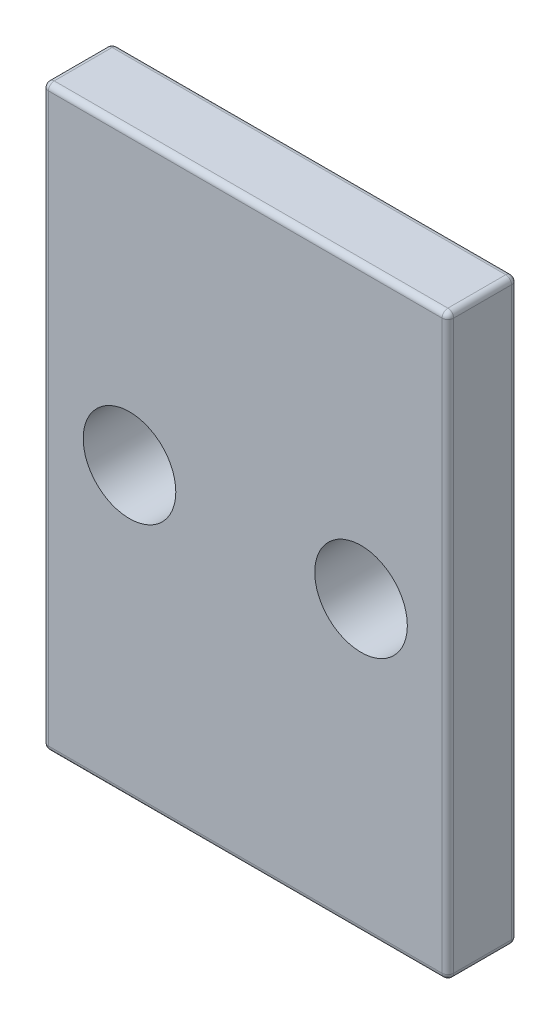
ISO-10303-21;
HEADER;
FILE_DESCRIPTION(('STEP AP214'),'2;1');
FILE_NAME('part.step','',(''),(''),'','','');
FILE_SCHEMA(('AUTOMOTIVE_DESIGN { 1 0 10303 214 1 1 1 1 }'));
ENDSEC;
DATA;
#1=APPLICATION_CONTEXT('core data for automotive mechanical design processes');
#2=APPLICATION_PROTOCOL_DEFINITION('international standard','automotive_design',2000,#1);
#3=PRODUCT_CONTEXT('',#1,'mechanical');
#4=PRODUCT('Part','Part','',(#3));
#5=PRODUCT_RELATED_PRODUCT_CATEGORY('part','',(#4));
#6=PRODUCT_DEFINITION_FORMATION('','',#4);
#7=PRODUCT_DEFINITION_CONTEXT('part definition',#1,'design');
#8=PRODUCT_DEFINITION('design','',#6,#7);
#9=PRODUCT_DEFINITION_SHAPE('','',#8);
#10=(LENGTH_UNIT() NAMED_UNIT(*) SI_UNIT(.MILLI.,.METRE.));
#11=(NAMED_UNIT(*) PLANE_ANGLE_UNIT() SI_UNIT($,.RADIAN.));
#12=(NAMED_UNIT(*) SI_UNIT($,.STERADIAN.) SOLID_ANGLE_UNIT());
#13=UNCERTAINTY_MEASURE_WITH_UNIT(LENGTH_MEASURE(1.E-05),#10,'distance_accuracy_value','');
#14=(GEOMETRIC_REPRESENTATION_CONTEXT(3) GLOBAL_UNCERTAINTY_ASSIGNED_CONTEXT((#13)) GLOBAL_UNIT_ASSIGNED_CONTEXT((#10,
#11,#12)) REPRESENTATION_CONTEXT('',''));
#15=CARTESIAN_POINT('',(0.,0.,0.));
#16=DIRECTION('',(0.,0.,1.));
#17=DIRECTION('',(1.,0.,0.));
#18=AXIS2_PLACEMENT_3D('',#15,#16,#17);
#19=CARTESIAN_POINT('',(0.,0.,6.));
#20=DIRECTION('',(0.,0.,1.));
#21=DIRECTION('',(1.,0.,0.));
#22=AXIS2_PLACEMENT_3D('',#19,#20,#21);
#23=PLANE('',#22);
#24=DIRECTION('',(0.,1.,0.));
#25=VECTOR('',#24,1.);
#26=CARTESIAN_POINT('',(17.,25.,6.));
#27=LINE('',#26,#25);
#28=CARTESIAN_POINT('',(17.,-24.5,6.));
#29=VERTEX_POINT('',#28);
#30=CARTESIAN_POINT('',(17.,24.5,6.));
#31=VERTEX_POINT('',#30);
#32=EDGE_CURVE('E171',#29,#31,#27,.T.);
#33=ORIENTED_EDGE('',*,*,#32,.T.);
#34=DIRECTION('',(-1.,0.,0.));
#35=VECTOR('',#34,1.);
#36=CARTESIAN_POINT('',(-17.5,24.5,6.));
#37=LINE('',#36,#35);
#38=CARTESIAN_POINT('',(-17.,24.5,6.));
#39=VERTEX_POINT('',#38);
#40=EDGE_CURVE('E140',#31,#39,#37,.T.);
#41=ORIENTED_EDGE('',*,*,#40,.T.);
#42=DIRECTION('',(0.,-1.,0.));
#43=VECTOR('',#42,1.);
#44=CARTESIAN_POINT('',(-17.,-25.,6.));
#45=LINE('',#44,#43);
#46=CARTESIAN_POINT('',(-17.,-24.5,6.));
#47=VERTEX_POINT('',#46);
#48=EDGE_CURVE('E159',#39,#47,#45,.T.);
#49=ORIENTED_EDGE('',*,*,#48,.T.);
#50=DIRECTION('',(1.,0.,0.));
#51=VECTOR('',#50,1.);
#52=CARTESIAN_POINT('',(17.5,-24.5,6.));
#53=LINE('',#52,#51);
#54=EDGE_CURVE('E166',#47,#29,#53,.T.);
#55=ORIENTED_EDGE('',*,*,#54,.T.);
#56=EDGE_LOOP('',(#33,#41,#49,#55));
#57=FACE_BOUND('',#56,.T.);
#58=CARTESIAN_POINT('',(-10.,0.,6.));
#59=DIRECTION('',(0.,0.,1.));
#60=DIRECTION('',(1.,0.,0.));
#61=AXIS2_PLACEMENT_3D('',#58,#59,#60);
#62=CIRCLE('',#61,4.);
#63=CARTESIAN_POINT('',(-6.,0.,6.));
#64=VERTEX_POINT('',#63);
#65=EDGE_CURVE('E167',#64,#64,#62,.T.);
#66=ORIENTED_EDGE('',*,*,#65,.F.);
#67=EDGE_LOOP('',(#66));
#68=FACE_BOUND('',#67,.T.);
#69=CARTESIAN_POINT('',(10.,0.,6.));
#70=DIRECTION('',(0.,0.,1.));
#71=DIRECTION('',(1.,0.,0.));
#72=AXIS2_PLACEMENT_3D('',#69,#70,#71);
#73=CIRCLE('',#72,4.);
#74=CARTESIAN_POINT('',(14.,0.,6.));
#75=VERTEX_POINT('',#74);
#76=EDGE_CURVE('E320',#75,#75,#73,.T.);
#77=ORIENTED_EDGE('',*,*,#76,.F.);
#78=EDGE_LOOP('',(#77));
#79=FACE_BOUND('',#78,.T.);
#80=ADVANCED_FACE('F45',(#57,#68,#79),#23,.T.);
#81=CARTESIAN_POINT('',(0.,0.,0.));
#82=DIRECTION('',(0.,0.,1.));
#83=DIRECTION('',(1.,0.,0.));
#84=AXIS2_PLACEMENT_3D('',#81,#82,#83);
#85=PLANE('',#84);
#86=DIRECTION('',(0.,-1.,0.));
#87=VECTOR('',#86,1.);
#88=CARTESIAN_POINT('',(-17.,0.,0.));
#89=LINE('',#88,#87);
#90=CARTESIAN_POINT('',(-17.,-24.5,0.));
#91=VERTEX_POINT('',#90);
#92=CARTESIAN_POINT('',(-17.,24.5,0.));
#93=VERTEX_POINT('',#92);
#94=EDGE_CURVE('E190',#91,#93,#89,.F.);
#95=ORIENTED_EDGE('',*,*,#94,.T.);
#96=DIRECTION('',(-1.,0.,0.));
#97=VECTOR('',#96,1.);
#98=CARTESIAN_POINT('',(0.,24.5,0.));
#99=LINE('',#98,#97);
#100=CARTESIAN_POINT('',(17.,24.5,0.));
#101=VERTEX_POINT('',#100);
#102=EDGE_CURVE('E199',#93,#101,#99,.F.);
#103=ORIENTED_EDGE('',*,*,#102,.T.);
#104=DIRECTION('',(0.,1.,0.));
#105=VECTOR('',#104,1.);
#106=CARTESIAN_POINT('',(17.,0.,0.));
#107=LINE('',#106,#105);
#108=CARTESIAN_POINT('',(17.,-24.5,0.));
#109=VERTEX_POINT('',#108);
#110=EDGE_CURVE('E196',#101,#109,#107,.F.);
#111=ORIENTED_EDGE('',*,*,#110,.T.);
#112=DIRECTION('',(1.,0.,0.));
#113=VECTOR('',#112,1.);
#114=CARTESIAN_POINT('',(0.,-24.5,0.));
#115=LINE('',#114,#113);
#116=EDGE_CURVE('E193',#109,#91,#115,.F.);
#117=ORIENTED_EDGE('',*,*,#116,.T.);
#118=EDGE_LOOP('',(#95,#103,#111,#117));
#119=FACE_BOUND('',#118,.T.);
#120=CARTESIAN_POINT('',(-10.,0.,0.));
#121=DIRECTION('',(0.,0.,1.));
#122=DIRECTION('',(1.,0.,0.));
#123=AXIS2_PLACEMENT_3D('',#120,#121,#122);
#124=CIRCLE('',#123,4.);
#125=CARTESIAN_POINT('',(-6.,0.,0.));
#126=VERTEX_POINT('',#125);
#127=EDGE_CURVE('E326',#126,#126,#124,.T.);
#128=ORIENTED_EDGE('',*,*,#127,.T.);
#129=EDGE_LOOP('',(#128));
#130=FACE_BOUND('',#129,.T.);
#131=CARTESIAN_POINT('',(10.,0.,0.));
#132=DIRECTION('',(0.,0.,1.));
#133=DIRECTION('',(1.,0.,0.));
#134=AXIS2_PLACEMENT_3D('',#131,#132,#133);
#135=CIRCLE('',#134,4.);
#136=CARTESIAN_POINT('',(14.,0.,0.));
#137=VERTEX_POINT('',#136);
#138=EDGE_CURVE('E313',#137,#137,#135,.T.);
#139=ORIENTED_EDGE('',*,*,#138,.T.);
#140=EDGE_LOOP('',(#139));
#141=FACE_BOUND('',#140,.T.);
#142=ADVANCED_FACE('F389',(#119,#130,#141),#85,.F.);
#143=CARTESIAN_POINT('',(17.5,25.,6.));
#144=DIRECTION('',(-1.,0.,0.));
#145=DIRECTION('',(0.,-1.,0.));
#146=AXIS2_PLACEMENT_3D('',#143,#144,#145);
#147=PLANE('',#146);
#148=DIRECTION('',(0.,0.,-1.));
#149=VECTOR('',#148,1.);
#150=CARTESIAN_POINT('',(17.5,24.5,6.));
#151=LINE('',#150,#149);
#152=CARTESIAN_POINT('',(17.5,24.5,0.5));
#153=VERTEX_POINT('',#152);
#154=CARTESIAN_POINT('',(17.5,24.5,5.5));
#155=VERTEX_POINT('',#154);
#156=EDGE_CURVE('E209',#153,#155,#151,.F.);
#157=ORIENTED_EDGE('',*,*,#156,.T.);
#158=DIRECTION('',(0.,1.,0.));
#159=VECTOR('',#158,1.);
#160=CARTESIAN_POINT('',(17.5,-25.,5.5));
#161=LINE('',#160,#159);
#162=CARTESIAN_POINT('',(17.5,-24.5,5.5));
#163=VERTEX_POINT('',#162);
#164=EDGE_CURVE('E212',#155,#163,#161,.F.);
#165=ORIENTED_EDGE('',*,*,#164,.T.);
#166=DIRECTION('',(0.,0.,-1.));
#167=VECTOR('',#166,1.);
#168=CARTESIAN_POINT('',(17.5,-24.5,6.));
#169=LINE('',#168,#167);
#170=CARTESIAN_POINT('',(17.5,-24.5,0.5));
#171=VERTEX_POINT('',#170);
#172=EDGE_CURVE('E203',#163,#171,#169,.T.);
#173=ORIENTED_EDGE('',*,*,#172,.T.);
#174=DIRECTION('',(0.,1.,0.));
#175=VECTOR('',#174,1.);
#176=CARTESIAN_POINT('',(17.5,25.,0.5));
#177=LINE('',#176,#175);
#178=EDGE_CURVE('E206',#171,#153,#177,.T.);
#179=ORIENTED_EDGE('',*,*,#178,.T.);
#180=EDGE_LOOP('',(#157,#165,#173,#179));
#181=FACE_BOUND('',#180,.T.);
#182=ADVANCED_FACE('F395',(#181),#147,.F.);
#183=CARTESIAN_POINT('',(-17.5,25.,6.));
#184=DIRECTION('',(0.,-1.,0.));
#185=DIRECTION('',(0.,0.,-1.));
#186=AXIS2_PLACEMENT_3D('',#183,#184,#185);
#187=PLANE('',#186);
#188=DIRECTION('',(-1.,0.,0.));
#189=VECTOR('',#188,1.);
#190=CARTESIAN_POINT('',(17.5,25.,5.5));
#191=LINE('',#190,#189);
#192=CARTESIAN_POINT('',(-17.,25.,5.5));
#193=VERTEX_POINT('',#192);
#194=CARTESIAN_POINT('',(17.,25.,5.5));
#195=VERTEX_POINT('',#194);
#196=EDGE_CURVE('E142',#193,#195,#191,.F.);
#197=ORIENTED_EDGE('',*,*,#196,.T.);
#198=DIRECTION('',(0.,0.,-1.));
#199=VECTOR('',#198,1.);
#200=CARTESIAN_POINT('',(17.,25.,6.));
#201=LINE('',#200,#199);
#202=CARTESIAN_POINT('',(17.,25.,0.5));
#203=VERTEX_POINT('',#202);
#204=EDGE_CURVE('E187',#195,#203,#201,.T.);
#205=ORIENTED_EDGE('',*,*,#204,.T.);
#206=DIRECTION('',(-1.,0.,0.));
#207=VECTOR('',#206,1.);
#208=CARTESIAN_POINT('',(-17.5,25.,0.5));
#209=LINE('',#208,#207);
#210=CARTESIAN_POINT('',(-17.,25.,0.5));
#211=VERTEX_POINT('',#210);
#212=EDGE_CURVE('E178',#203,#211,#209,.T.);
#213=ORIENTED_EDGE('',*,*,#212,.T.);
#214=DIRECTION('',(0.,0.,-1.));
#215=VECTOR('',#214,1.);
#216=CARTESIAN_POINT('',(-17.,25.,6.));
#217=LINE('',#216,#215);
#218=EDGE_CURVE('E174',#211,#193,#217,.F.);
#219=ORIENTED_EDGE('',*,*,#218,.T.);
#220=EDGE_LOOP('',(#197,#205,#213,#219));
#221=FACE_BOUND('',#220,.T.);
#222=ADVANCED_FACE('F359',(#221),#187,.F.);
#223=CARTESIAN_POINT('',(-17.5,25.,6.));
#224=DIRECTION('',(1.,0.,0.));
#225=DIRECTION('',(0.,1.,0.));
#226=AXIS2_PLACEMENT_3D('',#223,#224,#225);
#227=PLANE('',#226);
#228=DIRECTION('',(0.,-1.,0.));
#229=VECTOR('',#228,1.);
#230=CARTESIAN_POINT('',(-17.5,25.,5.5));
#231=LINE('',#230,#229);
#232=CARTESIAN_POINT('',(-17.5,-24.5,5.5));
#233=VERTEX_POINT('',#232);
#234=CARTESIAN_POINT('',(-17.5,24.5,5.5));
#235=VERTEX_POINT('',#234);
#236=EDGE_CURVE('E55',#233,#235,#231,.F.);
#237=ORIENTED_EDGE('',*,*,#236,.T.);
#238=DIRECTION('',(0.,0.,-1.));
#239=VECTOR('',#238,1.);
#240=CARTESIAN_POINT('',(-17.5,24.5,6.));
#241=LINE('',#240,#239);
#242=CARTESIAN_POINT('',(-17.5,24.5,0.5));
#243=VERTEX_POINT('',#242);
#244=EDGE_CURVE('E11',#235,#243,#241,.T.);
#245=ORIENTED_EDGE('',*,*,#244,.T.);
#246=DIRECTION('',(0.,-1.,0.));
#247=VECTOR('',#246,1.);
#248=CARTESIAN_POINT('',(-17.5,25.,0.5));
#249=LINE('',#248,#247);
#250=CARTESIAN_POINT('',(-17.5,-24.5,0.5));
#251=VERTEX_POINT('',#250);
#252=EDGE_CURVE('E229',#243,#251,#249,.T.);
#253=ORIENTED_EDGE('',*,*,#252,.T.);
#254=DIRECTION('',(0.,0.,-1.));
#255=VECTOR('',#254,1.);
#256=CARTESIAN_POINT('',(-17.5,-24.5,6.));
#257=LINE('',#256,#255);
#258=EDGE_CURVE('E66',#251,#233,#257,.F.);
#259=ORIENTED_EDGE('',*,*,#258,.T.);
#260=EDGE_LOOP('',(#237,#245,#253,#259));
#261=FACE_BOUND('',#260,.T.);
#262=ADVANCED_FACE('F365',(#261),#227,.F.);
#263=CARTESIAN_POINT('',(-17.5,-25.,6.));
#264=DIRECTION('',(0.,1.,0.));
#265=DIRECTION('',(0.,0.,1.));
#266=AXIS2_PLACEMENT_3D('',#263,#264,#265);
#267=PLANE('',#266);
#268=DIRECTION('',(0.,0.,-1.));
#269=VECTOR('',#268,1.);
#270=CARTESIAN_POINT('',(17.,-25.,6.));
#271=LINE('',#270,#269);
#272=CARTESIAN_POINT('',(17.,-25.,0.5));
#273=VERTEX_POINT('',#272);
#274=CARTESIAN_POINT('',(17.,-25.,5.5));
#275=VERTEX_POINT('',#274);
#276=EDGE_CURVE('E222',#273,#275,#271,.F.);
#277=ORIENTED_EDGE('',*,*,#276,.T.);
#278=DIRECTION('',(1.,0.,0.));
#279=VECTOR('',#278,1.);
#280=CARTESIAN_POINT('',(-17.5,-25.,5.5));
#281=LINE('',#280,#279);
#282=CARTESIAN_POINT('',(-17.,-25.,5.5));
#283=VERTEX_POINT('',#282);
#284=EDGE_CURVE('E225',#275,#283,#281,.F.);
#285=ORIENTED_EDGE('',*,*,#284,.T.);
#286=DIRECTION('',(0.,0.,-1.));
#287=VECTOR('',#286,1.);
#288=CARTESIAN_POINT('',(-17.,-25.,6.));
#289=LINE('',#288,#287);
#290=CARTESIAN_POINT('',(-17.,-25.,0.5));
#291=VERTEX_POINT('',#290);
#292=EDGE_CURVE('E216',#283,#291,#289,.T.);
#293=ORIENTED_EDGE('',*,*,#292,.T.);
#294=DIRECTION('',(1.,0.,0.));
#295=VECTOR('',#294,1.);
#296=CARTESIAN_POINT('',(-17.5,-25.,0.5));
#297=LINE('',#296,#295);
#298=EDGE_CURVE('E219',#291,#273,#297,.T.);
#299=ORIENTED_EDGE('',*,*,#298,.T.);
#300=EDGE_LOOP('',(#277,#285,#293,#299));
#301=FACE_BOUND('',#300,.T.);
#302=ADVANCED_FACE('F402',(#301),#267,.F.);
#303=CARTESIAN_POINT('',(-10.,0.,6.));
#304=DIRECTION('',(0.,0.,-1.));
#305=DIRECTION('',(-1.,0.,0.));
#306=AXIS2_PLACEMENT_3D('',#303,#304,#305);
#307=CYLINDRICAL_SURFACE('',#306,4.);
#308=ORIENTED_EDGE('',*,*,#65,.T.);
#309=EDGE_LOOP('',(#308));
#310=FACE_BOUND('',#309,.T.);
#311=ORIENTED_EDGE('',*,*,#127,.F.);
#312=EDGE_LOOP('',(#311));
#313=FACE_BOUND('',#312,.T.);
#314=ADVANCED_FACE('F399',(#310,#313),#307,.F.);
#315=CARTESIAN_POINT('',(10.,0.,6.));
#316=DIRECTION('',(0.,0.,-1.));
#317=DIRECTION('',(-1.,0.,0.));
#318=AXIS2_PLACEMENT_3D('',#315,#316,#317);
#319=CYLINDRICAL_SURFACE('',#318,4.);
#320=ORIENTED_EDGE('',*,*,#76,.T.);
#321=EDGE_LOOP('',(#320));
#322=FACE_BOUND('',#321,.T.);
#323=ORIENTED_EDGE('',*,*,#138,.F.);
#324=EDGE_LOOP('',(#323));
#325=FACE_BOUND('',#324,.T.);
#326=ADVANCED_FACE('F558',(#322,#325),#319,.F.);
#327=CARTESIAN_POINT('',(-17.5,-24.5,0.5));
#328=DIRECTION('',(1.,0.,0.));
#329=DIRECTION('',(0.,0.,-1.));
#330=AXIS2_PLACEMENT_3D('',#327,#328,#329);
#331=CYLINDRICAL_SURFACE('',#330,0.5);
#332=CARTESIAN_POINT('',(17.,-24.5,0.5));
#333=DIRECTION('',(1.,0.,0.));
#334=DIRECTION('',(0.,0.,-1.));
#335=AXIS2_PLACEMENT_3D('',#332,#333,#334);
#336=CIRCLE('',#335,0.5);
#337=EDGE_CURVE('E49',#273,#109,#336,.T.);
#338=ORIENTED_EDGE('',*,*,#337,.F.);
#339=ORIENTED_EDGE('',*,*,#298,.F.);
#340=CARTESIAN_POINT('',(-17.,-24.5,0.5));
#341=DIRECTION('',(-1.,0.,0.));
#342=DIRECTION('',(0.,0.,1.));
#343=AXIS2_PLACEMENT_3D('',#340,#341,#342);
#344=CIRCLE('',#343,0.5);
#345=EDGE_CURVE('E304',#91,#291,#344,.T.);
#346=ORIENTED_EDGE('',*,*,#345,.F.);
#347=ORIENTED_EDGE('',*,*,#116,.F.);
#348=EDGE_LOOP('',(#338,#339,#346,#347));
#349=FACE_BOUND('',#348,.T.);
#350=ADVANCED_FACE('F47',(#349),#331,.T.);
#351=CARTESIAN_POINT('',(17.,-24.5,0.5));
#352=DIRECTION('',(0.,0.,-1.));
#353=DIRECTION('',(-1.,0.,0.));
#354=AXIS2_PLACEMENT_3D('',#351,#352,#353);
#355=SPHERICAL_SURFACE('',#354,0.5);
#356=CARTESIAN_POINT('',(17.,-24.5,0.5));
#357=DIRECTION('',(0.,0.,-1.));
#358=DIRECTION('',(-1.,0.,0.));
#359=AXIS2_PLACEMENT_3D('',#356,#357,#358);
#360=CIRCLE('',#359,0.5);
#361=EDGE_CURVE('E297',#273,#171,#360,.F.);
#362=ORIENTED_EDGE('',*,*,#361,.F.);
#363=ORIENTED_EDGE('',*,*,#337,.T.);
#364=CARTESIAN_POINT('',(17.,-24.5,0.5));
#365=DIRECTION('',(0.,-1.,0.));
#366=DIRECTION('',(0.,0.,-1.));
#367=AXIS2_PLACEMENT_3D('',#364,#365,#366);
#368=CIRCLE('',#367,0.5);
#369=EDGE_CURVE('E301',#171,#109,#368,.F.);
#370=ORIENTED_EDGE('',*,*,#369,.F.);
#371=EDGE_LOOP('',(#362,#363,#370));
#372=FACE_BOUND('',#371,.T.);
#373=ADVANCED_FACE('F544',(#372),#355,.T.);
#374=CARTESIAN_POINT('',(-17.,-24.5,0.5));
#375=DIRECTION('',(0.,-1.,0.));
#376=DIRECTION('',(0.,0.,-1.));
#377=AXIS2_PLACEMENT_3D('',#374,#375,#376);
#378=SPHERICAL_SURFACE('',#377,0.5);
#379=CARTESIAN_POINT('',(-17.,-24.5,0.5));
#380=DIRECTION('',(0.,-1.,0.));
#381=DIRECTION('',(0.,0.,-1.));
#382=AXIS2_PLACEMENT_3D('',#379,#380,#381);
#383=CIRCLE('',#382,0.5);
#384=EDGE_CURVE('E289',#91,#251,#383,.F.);
#385=ORIENTED_EDGE('',*,*,#384,.F.);
#386=ORIENTED_EDGE('',*,*,#345,.T.);
#387=CARTESIAN_POINT('',(-17.,-24.5,0.5));
#388=DIRECTION('',(0.,0.,-1.));
#389=DIRECTION('',(-1.,0.,0.));
#390=AXIS2_PLACEMENT_3D('',#387,#388,#389);
#391=CIRCLE('',#390,0.5);
#392=EDGE_CURVE('E293',#251,#291,#391,.F.);
#393=ORIENTED_EDGE('',*,*,#392,.F.);
#394=EDGE_LOOP('',(#385,#386,#393));
#395=FACE_BOUND('',#394,.T.);
#396=ADVANCED_FACE('F371',(#395),#378,.T.);
#397=CARTESIAN_POINT('',(17.,25.,0.5));
#398=DIRECTION('',(0.,1.,0.));
#399=DIRECTION('',(-1.,0.,0.));
#400=AXIS2_PLACEMENT_3D('',#397,#398,#399);
#401=CYLINDRICAL_SURFACE('',#400,0.5);
#402=ORIENTED_EDGE('',*,*,#369,.T.);
#403=ORIENTED_EDGE('',*,*,#110,.F.);
#404=CARTESIAN_POINT('',(17.,24.5,0.5));
#405=DIRECTION('',(0.,1.,0.));
#406=DIRECTION('',(0.,0.,1.));
#407=AXIS2_PLACEMENT_3D('',#404,#405,#406);
#408=CIRCLE('',#407,0.5);
#409=EDGE_CURVE('E282',#153,#101,#408,.T.);
#410=ORIENTED_EDGE('',*,*,#409,.F.);
#411=ORIENTED_EDGE('',*,*,#178,.F.);
#412=EDGE_LOOP('',(#402,#403,#410,#411));
#413=FACE_BOUND('',#412,.T.);
#414=ADVANCED_FACE('F527',(#413),#401,.T.);
#415=CARTESIAN_POINT('',(17.,-24.5,6.));
#416=DIRECTION('',(0.,0.,-1.));
#417=DIRECTION('',(-1.,0.,0.));
#418=AXIS2_PLACEMENT_3D('',#415,#416,#417);
#419=CYLINDRICAL_SURFACE('',#418,0.5);
#420=ORIENTED_EDGE('',*,*,#361,.T.);
#421=ORIENTED_EDGE('',*,*,#172,.F.);
#422=CARTESIAN_POINT('',(17.,-24.5,5.5));
#423=DIRECTION('',(0.,0.,1.));
#424=DIRECTION('',(1.,0.,0.));
#425=AXIS2_PLACEMENT_3D('',#422,#423,#424);
#426=CIRCLE('',#425,0.5);
#427=EDGE_CURVE('E278',#275,#163,#426,.T.);
#428=ORIENTED_EDGE('',*,*,#427,.F.);
#429=ORIENTED_EDGE('',*,*,#276,.F.);
#430=EDGE_LOOP('',(#420,#421,#428,#429));
#431=FACE_BOUND('',#430,.T.);
#432=ADVANCED_FACE('F519',(#431),#419,.T.);
#433=CARTESIAN_POINT('',(0.,-24.5,5.5));
#434=DIRECTION('',(-1.,0.,0.));
#435=DIRECTION('',(0.,0.,1.));
#436=AXIS2_PLACEMENT_3D('',#433,#434,#435);
#437=CYLINDRICAL_SURFACE('',#436,0.5);
#438=CARTESIAN_POINT('',(-17.,-24.5,5.5));
#439=DIRECTION('',(-1.,0.,0.));
#440=DIRECTION('',(0.,0.,1.));
#441=AXIS2_PLACEMENT_3D('',#438,#439,#440);
#442=CIRCLE('',#441,0.5);
#443=EDGE_CURVE('E270',#283,#47,#442,.T.);
#444=ORIENTED_EDGE('',*,*,#443,.F.);
#445=ORIENTED_EDGE('',*,*,#284,.F.);
#446=CARTESIAN_POINT('',(17.,-24.5,5.5));
#447=DIRECTION('',(1.,0.,0.));
#448=DIRECTION('',(0.,0.,-1.));
#449=AXIS2_PLACEMENT_3D('',#446,#447,#448);
#450=CIRCLE('',#449,0.5);
#451=EDGE_CURVE('E274',#29,#275,#450,.T.);
#452=ORIENTED_EDGE('',*,*,#451,.F.);
#453=ORIENTED_EDGE('',*,*,#54,.F.);
#454=EDGE_LOOP('',(#444,#445,#452,#453));
#455=FACE_BOUND('',#454,.T.);
#456=ADVANCED_FACE('F340',(#455),#437,.T.);
#457=CARTESIAN_POINT('',(-17.,-24.5,6.));
#458=DIRECTION('',(0.,0.,-1.));
#459=DIRECTION('',(-1.,0.,0.));
#460=AXIS2_PLACEMENT_3D('',#457,#458,#459);
#461=CYLINDRICAL_SURFACE('',#460,0.5);
#462=ORIENTED_EDGE('',*,*,#392,.T.);
#463=ORIENTED_EDGE('',*,*,#292,.F.);
#464=CARTESIAN_POINT('',(-17.,-24.5,5.5));
#465=DIRECTION('',(0.,0.,1.));
#466=DIRECTION('',(1.,0.,0.));
#467=AXIS2_PLACEMENT_3D('',#464,#465,#466);
#468=CIRCLE('',#467,0.5);
#469=EDGE_CURVE('E267',#233,#283,#468,.T.);
#470=ORIENTED_EDGE('',*,*,#469,.F.);
#471=ORIENTED_EDGE('',*,*,#258,.F.);
#472=EDGE_LOOP('',(#462,#463,#470,#471));
#473=FACE_BOUND('',#472,.T.);
#474=ADVANCED_FACE('F374',(#473),#461,.T.);
#475=CARTESIAN_POINT('',(-17.,25.,0.5));
#476=DIRECTION('',(0.,-1.,0.));
#477=DIRECTION('',(1.,0.,0.));
#478=AXIS2_PLACEMENT_3D('',#475,#476,#477);
#479=CYLINDRICAL_SURFACE('',#478,0.5);
#480=ORIENTED_EDGE('',*,*,#384,.T.);
#481=ORIENTED_EDGE('',*,*,#252,.F.);
#482=CARTESIAN_POINT('',(-17.,24.5,0.5));
#483=DIRECTION('',(0.,1.,0.));
#484=DIRECTION('',(0.,0.,1.));
#485=AXIS2_PLACEMENT_3D('',#482,#483,#484);
#486=CIRCLE('',#485,0.5);
#487=EDGE_CURVE('E263',#93,#243,#486,.T.);
#488=ORIENTED_EDGE('',*,*,#487,.F.);
#489=ORIENTED_EDGE('',*,*,#94,.F.);
#490=EDGE_LOOP('',(#480,#481,#488,#489));
#491=FACE_BOUND('',#490,.T.);
#492=ADVANCED_FACE('F370',(#491),#479,.T.);
#493=CARTESIAN_POINT('',(-17.5,24.5,0.5));
#494=DIRECTION('',(-1.,0.,0.));
#495=DIRECTION('',(0.,0.,1.));
#496=AXIS2_PLACEMENT_3D('',#493,#494,#495);
#497=CYLINDRICAL_SURFACE('',#496,0.5);
#498=CARTESIAN_POINT('',(17.,24.5,0.5));
#499=DIRECTION('',(1.,0.,0.));
#500=DIRECTION('',(0.,0.,-1.));
#501=AXIS2_PLACEMENT_3D('',#498,#499,#500);
#502=CIRCLE('',#501,0.5);
#503=EDGE_CURVE('E285',#101,#203,#502,.T.);
#504=ORIENTED_EDGE('',*,*,#503,.F.);
#505=ORIENTED_EDGE('',*,*,#102,.F.);
#506=CARTESIAN_POINT('',(-17.,24.5,0.5));
#507=DIRECTION('',(-1.,0.,0.));
#508=DIRECTION('',(0.,0.,1.));
#509=AXIS2_PLACEMENT_3D('',#506,#507,#508);
#510=CIRCLE('',#509,0.5);
#511=EDGE_CURVE('E259',#211,#93,#510,.T.);
#512=ORIENTED_EDGE('',*,*,#511,.F.);
#513=ORIENTED_EDGE('',*,*,#212,.F.);
#514=EDGE_LOOP('',(#504,#505,#512,#513));
#515=FACE_BOUND('',#514,.T.);
#516=ADVANCED_FACE('F488',(#515),#497,.T.);
#517=CARTESIAN_POINT('',(17.,24.5,0.5));
#518=DIRECTION('',(0.,0.,-1.));
#519=DIRECTION('',(-1.,0.,0.));
#520=AXIS2_PLACEMENT_3D('',#517,#518,#519);
#521=SPHERICAL_SURFACE('',#520,0.5);
#522=ORIENTED_EDGE('',*,*,#409,.T.);
#523=ORIENTED_EDGE('',*,*,#503,.T.);
#524=CARTESIAN_POINT('',(17.,24.5,0.5));
#525=DIRECTION('',(0.,0.,-1.));
#526=DIRECTION('',(-1.,0.,0.));
#527=AXIS2_PLACEMENT_3D('',#524,#525,#526);
#528=CIRCLE('',#527,0.5);
#529=EDGE_CURVE('E255',#153,#203,#528,.F.);
#530=ORIENTED_EDGE('',*,*,#529,.F.);
#531=EDGE_LOOP('',(#522,#523,#530));
#532=FACE_BOUND('',#531,.T.);
#533=ADVANCED_FACE('F386',(#532),#521,.T.);
#534=CARTESIAN_POINT('',(17.,-24.5,5.5));
#535=DIRECTION('',(0.,-1.,0.));
#536=DIRECTION('',(0.,0.,-1.));
#537=AXIS2_PLACEMENT_3D('',#534,#535,#536);
#538=SPHERICAL_SURFACE('',#537,0.5);
#539=ORIENTED_EDGE('',*,*,#451,.T.);
#540=ORIENTED_EDGE('',*,*,#427,.T.);
#541=CARTESIAN_POINT('',(17.,-24.5,5.5));
#542=DIRECTION('',(0.,-1.,0.));
#543=DIRECTION('',(0.,0.,-1.));
#544=AXIS2_PLACEMENT_3D('',#541,#542,#543);
#545=CIRCLE('',#544,0.5);
#546=EDGE_CURVE('E252',#29,#163,#545,.F.);
#547=ORIENTED_EDGE('',*,*,#546,.F.);
#548=EDGE_LOOP('',(#539,#540,#547));
#549=FACE_BOUND('',#548,.T.);
#550=ADVANCED_FACE('F343',(#549),#538,.T.);
#551=CARTESIAN_POINT('',(-17.,-24.5,5.5));
#552=DIRECTION('',(0.,-1.,0.));
#553=DIRECTION('',(0.,0.,-1.));
#554=AXIS2_PLACEMENT_3D('',#551,#552,#553);
#555=SPHERICAL_SURFACE('',#554,0.5);
#556=ORIENTED_EDGE('',*,*,#469,.T.);
#557=ORIENTED_EDGE('',*,*,#443,.T.);
#558=CARTESIAN_POINT('',(-17.,-24.5,5.5));
#559=DIRECTION('',(0.,-1.,0.));
#560=DIRECTION('',(0.,0.,-1.));
#561=AXIS2_PLACEMENT_3D('',#558,#559,#560);
#562=CIRCLE('',#561,0.5);
#563=EDGE_CURVE('E162',#233,#47,#562,.F.);
#564=ORIENTED_EDGE('',*,*,#563,.F.);
#565=EDGE_LOOP('',(#556,#557,#564));
#566=FACE_BOUND('',#565,.T.);
#567=ADVANCED_FACE('F376',(#566),#555,.T.);
#568=CARTESIAN_POINT('',(-17.,24.5,0.5));
#569=DIRECTION('',(0.,0.,-1.));
#570=DIRECTION('',(-1.,0.,0.));
#571=AXIS2_PLACEMENT_3D('',#568,#569,#570);
#572=SPHERICAL_SURFACE('',#571,0.5);
#573=ORIENTED_EDGE('',*,*,#511,.T.);
#574=ORIENTED_EDGE('',*,*,#487,.T.);
#575=CARTESIAN_POINT('',(-17.,24.5,0.5));
#576=DIRECTION('',(0.,0.,-1.));
#577=DIRECTION('',(-1.,0.,0.));
#578=AXIS2_PLACEMENT_3D('',#575,#576,#577);
#579=CIRCLE('',#578,0.5);
#580=EDGE_CURVE('E247',#211,#243,#579,.F.);
#581=ORIENTED_EDGE('',*,*,#580,.F.);
#582=EDGE_LOOP('',(#573,#574,#581));
#583=FACE_BOUND('',#582,.T.);
#584=ADVANCED_FACE('F378',(#583),#572,.T.);
#585=CARTESIAN_POINT('',(17.,24.5,6.));
#586=DIRECTION('',(0.,0.,-1.));
#587=DIRECTION('',(-1.,0.,0.));
#588=AXIS2_PLACEMENT_3D('',#585,#586,#587);
#589=CYLINDRICAL_SURFACE('',#588,0.5);
#590=ORIENTED_EDGE('',*,*,#529,.T.);
#591=ORIENTED_EDGE('',*,*,#204,.F.);
#592=CARTESIAN_POINT('',(17.,24.5,5.5));
#593=DIRECTION('',(0.,0.,1.));
#594=DIRECTION('',(1.,0.,0.));
#595=AXIS2_PLACEMENT_3D('',#592,#593,#594);
#596=CIRCLE('',#595,0.5);
#597=EDGE_CURVE('E243',#155,#195,#596,.T.);
#598=ORIENTED_EDGE('',*,*,#597,.F.);
#599=ORIENTED_EDGE('',*,*,#156,.F.);
#600=EDGE_LOOP('',(#590,#591,#598,#599));
#601=FACE_BOUND('',#600,.T.);
#602=ADVANCED_FACE('F355',(#601),#589,.T.);
#603=CARTESIAN_POINT('',(17.,0.,5.5));
#604=DIRECTION('',(0.,-1.,0.));
#605=DIRECTION('',(1.,0.,0.));
#606=AXIS2_PLACEMENT_3D('',#603,#604,#605);
#607=CYLINDRICAL_SURFACE('',#606,0.5);
#608=ORIENTED_EDGE('',*,*,#546,.T.);
#609=ORIENTED_EDGE('',*,*,#164,.F.);
#610=CARTESIAN_POINT('',(17.,24.5,5.5));
#611=DIRECTION('',(0.,1.,0.));
#612=DIRECTION('',(0.,0.,1.));
#613=AXIS2_PLACEMENT_3D('',#610,#611,#612);
#614=CIRCLE('',#613,0.5);
#615=EDGE_CURVE('E156',#31,#155,#614,.T.);
#616=ORIENTED_EDGE('',*,*,#615,.F.);
#617=ORIENTED_EDGE('',*,*,#32,.F.);
#618=EDGE_LOOP('',(#608,#609,#616,#617));
#619=FACE_BOUND('',#618,.T.);
#620=ADVANCED_FACE('F347',(#619),#607,.T.);
#621=CARTESIAN_POINT('',(-17.,0.,5.5));
#622=DIRECTION('',(0.,1.,0.));
#623=DIRECTION('',(-1.,0.,0.));
#624=AXIS2_PLACEMENT_3D('',#621,#622,#623);
#625=CYLINDRICAL_SURFACE('',#624,0.5);
#626=ORIENTED_EDGE('',*,*,#563,.T.);
#627=ORIENTED_EDGE('',*,*,#48,.F.);
#628=CARTESIAN_POINT('',(-17.,24.5,5.5));
#629=DIRECTION('',(0.,1.,0.));
#630=DIRECTION('',(0.,0.,1.));
#631=AXIS2_PLACEMENT_3D('',#628,#629,#630);
#632=CIRCLE('',#631,0.5);
#633=EDGE_CURVE('E149',#235,#39,#632,.T.);
#634=ORIENTED_EDGE('',*,*,#633,.F.);
#635=ORIENTED_EDGE('',*,*,#236,.F.);
#636=EDGE_LOOP('',(#626,#627,#634,#635));
#637=FACE_BOUND('',#636,.T.);
#638=ADVANCED_FACE('F160',(#637),#625,.T.);
#639=CARTESIAN_POINT('',(-17.,24.5,6.));
#640=DIRECTION('',(0.,0.,-1.));
#641=DIRECTION('',(-1.,0.,0.));
#642=AXIS2_PLACEMENT_3D('',#639,#640,#641);
#643=CYLINDRICAL_SURFACE('',#642,0.5);
#644=ORIENTED_EDGE('',*,*,#580,.T.);
#645=ORIENTED_EDGE('',*,*,#244,.F.);
#646=CARTESIAN_POINT('',(-17.,24.5,5.5));
#647=DIRECTION('',(0.,0.,1.));
#648=DIRECTION('',(1.,0.,0.));
#649=AXIS2_PLACEMENT_3D('',#646,#647,#648);
#650=CIRCLE('',#649,0.5);
#651=EDGE_CURVE('E153',#193,#235,#650,.T.);
#652=ORIENTED_EDGE('',*,*,#651,.F.);
#653=ORIENTED_EDGE('',*,*,#218,.F.);
#654=EDGE_LOOP('',(#644,#645,#652,#653));
#655=FACE_BOUND('',#654,.T.);
#656=ADVANCED_FACE('F363',(#655),#643,.T.);
#657=CARTESIAN_POINT('',(17.,24.5,5.5));
#658=DIRECTION('',(1.,0.,0.));
#659=DIRECTION('',(0.,0.,-1.));
#660=AXIS2_PLACEMENT_3D('',#657,#658,#659);
#661=SPHERICAL_SURFACE('',#660,0.5);
#662=ORIENTED_EDGE('',*,*,#615,.T.);
#663=ORIENTED_EDGE('',*,*,#597,.T.);
#664=CARTESIAN_POINT('',(17.,24.5,5.5));
#665=DIRECTION('',(1.,0.,0.));
#666=DIRECTION('',(0.,0.,-1.));
#667=AXIS2_PLACEMENT_3D('',#664,#665,#666);
#668=CIRCLE('',#667,0.5);
#669=EDGE_CURVE('E146',#31,#195,#668,.F.);
#670=ORIENTED_EDGE('',*,*,#669,.F.);
#671=EDGE_LOOP('',(#662,#663,#670));
#672=FACE_BOUND('',#671,.T.);
#673=ADVANCED_FACE('F351',(#672),#661,.T.);
#674=CARTESIAN_POINT('',(-17.,24.5,5.5));
#675=DIRECTION('',(-1.,0.,0.));
#676=DIRECTION('',(0.,0.,1.));
#677=AXIS2_PLACEMENT_3D('',#674,#675,#676);
#678=SPHERICAL_SURFACE('',#677,0.5);
#679=ORIENTED_EDGE('',*,*,#651,.T.);
#680=ORIENTED_EDGE('',*,*,#633,.T.);
#681=CARTESIAN_POINT('',(-17.,24.5,5.5));
#682=DIRECTION('',(-1.,0.,0.));
#683=DIRECTION('',(0.,0.,1.));
#684=AXIS2_PLACEMENT_3D('',#681,#682,#683);
#685=CIRCLE('',#684,0.5);
#686=EDGE_CURVE('E136',#193,#39,#685,.F.);
#687=ORIENTED_EDGE('',*,*,#686,.F.);
#688=EDGE_LOOP('',(#679,#680,#687));
#689=FACE_BOUND('',#688,.T.);
#690=ADVANCED_FACE('F151',(#689),#678,.T.);
#691=CARTESIAN_POINT('',(0.,24.5,5.5));
#692=DIRECTION('',(1.,0.,0.));
#693=DIRECTION('',(0.,0.,-1.));
#694=AXIS2_PLACEMENT_3D('',#691,#692,#693);
#695=CYLINDRICAL_SURFACE('',#694,0.5);
#696=ORIENTED_EDGE('',*,*,#669,.T.);
#697=ORIENTED_EDGE('',*,*,#196,.F.);
#698=ORIENTED_EDGE('',*,*,#686,.T.);
#699=ORIENTED_EDGE('',*,*,#40,.F.);
#700=EDGE_LOOP('',(#696,#697,#698,#699));
#701=FACE_BOUND('',#700,.T.);
#702=ADVANCED_FACE('F138',(#701),#695,.T.);
#703=CLOSED_SHELL('',(#80,#142,#182,#222,#262,#302,#314,#326,#350,#373,#396,#414,#432,#456,#474,
#492,#516,#533,#550,#567,#584,#602,#620,#638,#656,#673,#690,#702));
#704=MANIFOLD_SOLID_BREP('B2',#703);
#705=ADVANCED_BREP_SHAPE_REPRESENTATION('',(#18,#704),#14);
#706=SHAPE_DEFINITION_REPRESENTATION(#9,#705);
ENDSEC;
END-ISO-10303-21;
